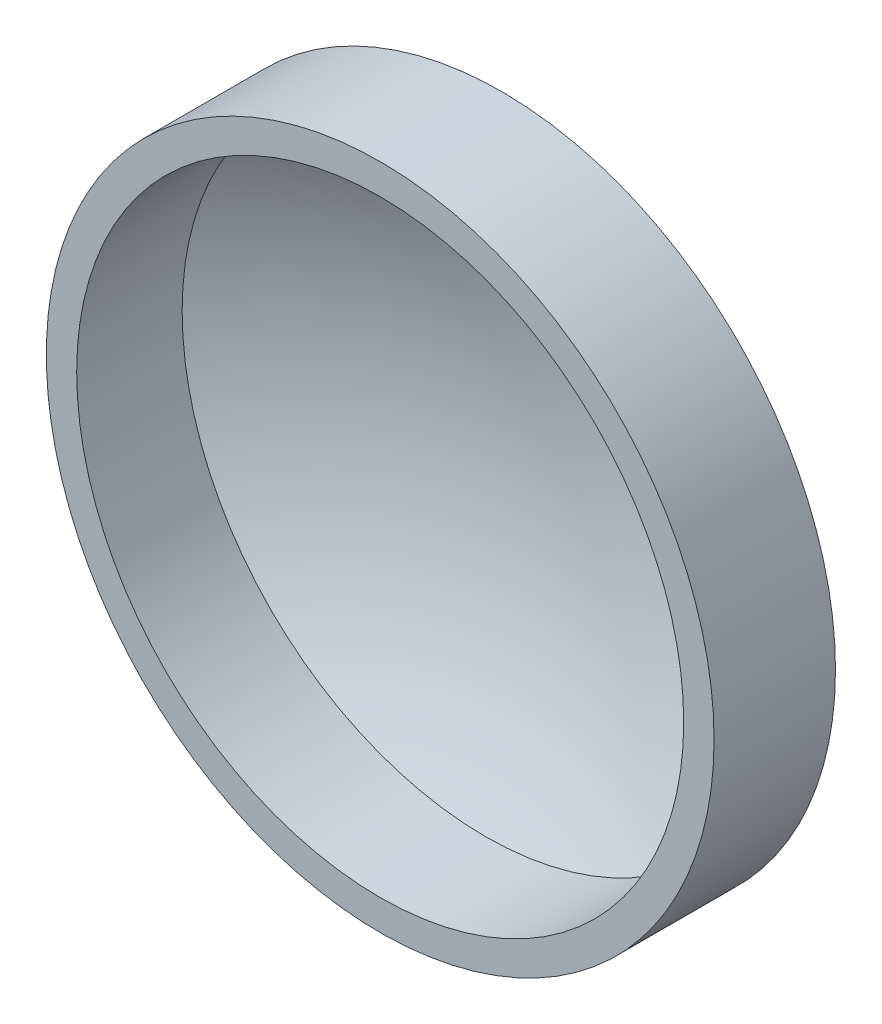
ISO-10303-21;
HEADER;
FILE_DESCRIPTION(('STEP AP214'),'2;1');
FILE_NAME('part.step','',(''),(''),'','','');
FILE_SCHEMA(('AUTOMOTIVE_DESIGN { 1 0 10303 214 1 1 1 1 }'));
ENDSEC;
DATA;
#1=APPLICATION_CONTEXT('core data for automotive mechanical design processes');
#2=APPLICATION_PROTOCOL_DEFINITION('international standard','automotive_design',2000,#1);
#3=PRODUCT_CONTEXT('',#1,'mechanical');
#4=PRODUCT('Part','Part','',(#3));
#5=PRODUCT_RELATED_PRODUCT_CATEGORY('part','',(#4));
#6=PRODUCT_DEFINITION_FORMATION('','',#4);
#7=PRODUCT_DEFINITION_CONTEXT('part definition',#1,'design');
#8=PRODUCT_DEFINITION('design','',#6,#7);
#9=PRODUCT_DEFINITION_SHAPE('','',#8);
#10=(LENGTH_UNIT() NAMED_UNIT(*) SI_UNIT(.MILLI.,.METRE.));
#11=(NAMED_UNIT(*) PLANE_ANGLE_UNIT() SI_UNIT($,.RADIAN.));
#12=(NAMED_UNIT(*) SI_UNIT($,.STERADIAN.) SOLID_ANGLE_UNIT());
#13=UNCERTAINTY_MEASURE_WITH_UNIT(LENGTH_MEASURE(1.E-05),#10,'distance_accuracy_value','');
#14=(GEOMETRIC_REPRESENTATION_CONTEXT(3) GLOBAL_UNCERTAINTY_ASSIGNED_CONTEXT((#13)) GLOBAL_UNIT_ASSIGNED_CONTEXT((#10,
#11,#12)) REPRESENTATION_CONTEXT('',''));
#15=CARTESIAN_POINT('',(0.,0.,0.));
#16=DIRECTION('',(0.,0.,1.));
#17=DIRECTION('',(1.,0.,0.));
#18=AXIS2_PLACEMENT_3D('',#15,#16,#17);
#19=CARTESIAN_POINT('',(0.0288663832635275,0.,18.5419913668861));
#20=DIRECTION('',(0.,-1.,0.));
#21=DIRECTION('',(1.,0.,0.));
#22=AXIS2_PLACEMENT_3D('',#19,#20,#21);
#23=CIRCLE('',#22,48.26);
#24=TRIMMED_CURVE('',#23,(PARAMETER_VALUE(-1.57139446987374)),
(PARAMETER_VALUE(1.57139446987374)),.T.,.PARAMETER.);
#25=CARTESIAN_POINT('',(0.,0.,18.5419913668861));
#26=DIRECTION('',(0.,0.,1.));
#27=AXIS1_PLACEMENT('',#25,#26);
#28=SURFACE_OF_REVOLUTION('',#24,#27);
#29=CARTESIAN_POINT('',(0.,0.,-29.718));
#30=VERTEX_POINT('',#29);
#31=VERTEX_LOOP('',#30);
#32=FACE_BOUND('',#31,.T.);
#33=CARTESIAN_POINT('',(0.,0.,-20.828));
#34=DIRECTION('',(0.,0.,1.));
#35=DIRECTION('',(1.,0.,0.));
#36=AXIS2_PLACEMENT_3D('',#33,#34,#35);
#37=CIRCLE('',#36,27.94);
#38=CARTESIAN_POINT('',(27.94,0.,-20.828));
#39=VERTEX_POINT('',#38);
#40=EDGE_CURVE('E11',#39,#39,#37,.T.);
#41=ORIENTED_EDGE('',*,*,#40,.F.);
#42=EDGE_LOOP('',(#41));
#43=FACE_BOUND('',#42,.T.);
#44=ADVANCED_FACE('F36',(#32,#43),#28,.T.);
#45=CARTESIAN_POINT('',(0.,0.,0.));
#46=DIRECTION('',(0.,0.,1.));
#47=DIRECTION('',(1.,0.,0.));
#48=AXIS2_PLACEMENT_3D('',#45,#46,#47);
#49=CYLINDRICAL_SURFACE('',#48,27.94);
#50=ORIENTED_EDGE('',*,*,#40,.T.);
#51=EDGE_LOOP('',(#50));
#52=FACE_BOUND('',#51,.T.);
#53=CARTESIAN_POINT('',(0.,0.,-10.668));
#54=DIRECTION('',(0.,0.,1.));
#55=DIRECTION('',(1.,0.,0.));
#56=AXIS2_PLACEMENT_3D('',#53,#54,#55);
#57=CIRCLE('',#56,27.94);
#58=CARTESIAN_POINT('',(27.94,0.,-10.668));
#59=VERTEX_POINT('',#58);
#60=EDGE_CURVE('E43',#59,#59,#57,.T.);
#61=ORIENTED_EDGE('',*,*,#60,.F.);
#62=EDGE_LOOP('',(#61));
#63=FACE_BOUND('',#62,.T.);
#64=ADVANCED_FACE('F69',(#52,#63),#49,.T.);
#65=CARTESIAN_POINT('',(0.,0.,-10.668));
#66=DIRECTION('',(0.,0.,1.));
#67=DIRECTION('',(1.,0.,0.));
#68=AXIS2_PLACEMENT_3D('',#65,#66,#67);
#69=PLANE('',#68);
#70=CARTESIAN_POINT('',(0.,0.,-10.668));
#71=DIRECTION('',(0.,0.,1.));
#72=DIRECTION('',(1.,0.,0.));
#73=AXIS2_PLACEMENT_3D('',#70,#71,#72);
#74=CIRCLE('',#73,25.4);
#75=CARTESIAN_POINT('',(25.4,0.,-10.668));
#76=VERTEX_POINT('',#75);
#77=EDGE_CURVE('E59',#76,#76,#74,.T.);
#78=ORIENTED_EDGE('',*,*,#77,.F.);
#79=EDGE_LOOP('',(#78));
#80=FACE_BOUND('',#79,.T.);
#81=ORIENTED_EDGE('',*,*,#60,.T.);
#82=EDGE_LOOP('',(#81));
#83=FACE_BOUND('',#82,.T.);
#84=ADVANCED_FACE('F53',(#80,#83),#69,.T.);
#85=CARTESIAN_POINT('',(0.0288663832635275,0.,18.5419913668861));
#86=DIRECTION('',(0.,-1.,0.));
#87=DIRECTION('',(1.,0.,0.));
#88=AXIS2_PLACEMENT_3D('',#85,#86,#87);
#89=CIRCLE('',#88,45.72);
#90=TRIMMED_CURVE('',#89,(PARAMETER_VALUE(-1.57142770004908)),
(PARAMETER_VALUE(1.57142770004908)),.T.,.PARAMETER.);
#91=CARTESIAN_POINT('',(0.,0.,18.5419913668861));
#92=DIRECTION('',(0.,0.,1.));
#93=AXIS1_PLACEMENT('',#91,#92);
#94=SURFACE_OF_REVOLUTION('',#90,#93);
#95=CARTESIAN_POINT('',(0.,0.,-27.1779995203825));
#96=VERTEX_POINT('',#95);
#97=VERTEX_LOOP('',#96);
#98=FACE_BOUND('',#97,.T.);
#99=CARTESIAN_POINT('',(0.,0.,-19.4925190020106));
#100=DIRECTION('',(0.,0.,1.));
#101=DIRECTION('',(1.,0.,0.));
#102=AXIS2_PLACEMENT_3D('',#99,#100,#101);
#103=CIRCLE('',#102,25.4);
#104=CARTESIAN_POINT('',(25.4,0.,-19.4925190020106));
#105=VERTEX_POINT('',#104);
#106=EDGE_CURVE('E57',#105,#105,#103,.T.);
#107=ORIENTED_EDGE('',*,*,#106,.T.);
#108=EDGE_LOOP('',(#107));
#109=FACE_BOUND('',#108,.T.);
#110=ADVANCED_FACE('F49',(#98,#109),#94,.F.);
#111=CARTESIAN_POINT('',(0.,0.,0.));
#112=DIRECTION('',(0.,0.,1.));
#113=DIRECTION('',(1.,0.,0.));
#114=AXIS2_PLACEMENT_3D('',#111,#112,#113);
#115=CYLINDRICAL_SURFACE('',#114,25.4);
#116=ORIENTED_EDGE('',*,*,#106,.F.);
#117=EDGE_LOOP('',(#116));
#118=FACE_BOUND('',#117,.T.);
#119=ORIENTED_EDGE('',*,*,#77,.T.);
#120=EDGE_LOOP('',(#119));
#121=FACE_BOUND('',#120,.T.);
#122=ADVANCED_FACE('F52',(#118,#121),#115,.F.);
#123=CLOSED_SHELL('',(#44,#64,#84,#110,#122));
#124=MANIFOLD_SOLID_BREP('B2',#123);
#125=ADVANCED_BREP_SHAPE_REPRESENTATION('',(#18,#124),#14);
#126=SHAPE_DEFINITION_REPRESENTATION(#9,#125);
ENDSEC;
END-ISO-10303-21;
